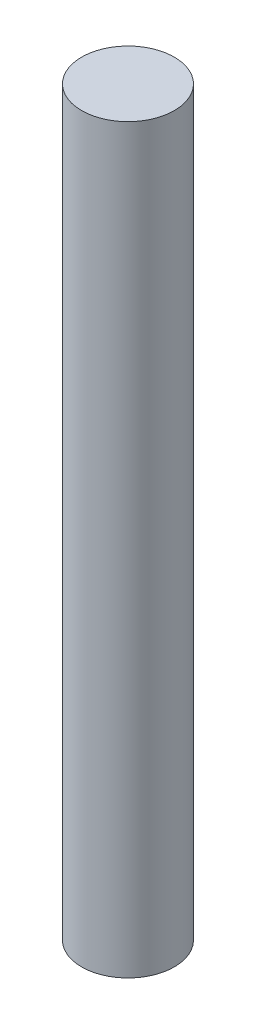
ISO-10303-21;
HEADER;
FILE_DESCRIPTION(('STEP AP214'),'2;1');
FILE_NAME('part.step','',(''),(''),'','','');
FILE_SCHEMA(('AUTOMOTIVE_DESIGN { 1 0 10303 214 1 1 1 1 }'));
ENDSEC;
DATA;
#1=APPLICATION_CONTEXT('core data for automotive mechanical design processes');
#2=APPLICATION_PROTOCOL_DEFINITION('international standard','automotive_design',2000,#1);
#3=PRODUCT_CONTEXT('',#1,'mechanical');
#4=PRODUCT('Part','Part','',(#3));
#5=PRODUCT_RELATED_PRODUCT_CATEGORY('part','',(#4));
#6=PRODUCT_DEFINITION_FORMATION('','',#4);
#7=PRODUCT_DEFINITION_CONTEXT('part definition',#1,'design');
#8=PRODUCT_DEFINITION('design','',#6,#7);
#9=PRODUCT_DEFINITION_SHAPE('','',#8);
#10=(LENGTH_UNIT() NAMED_UNIT(*) SI_UNIT(.MILLI.,.METRE.));
#11=(NAMED_UNIT(*) PLANE_ANGLE_UNIT() SI_UNIT($,.RADIAN.));
#12=(NAMED_UNIT(*) SI_UNIT($,.STERADIAN.) SOLID_ANGLE_UNIT());
#13=UNCERTAINTY_MEASURE_WITH_UNIT(LENGTH_MEASURE(1.E-05),#10,'distance_accuracy_value','');
#14=(GEOMETRIC_REPRESENTATION_CONTEXT(3) GLOBAL_UNCERTAINTY_ASSIGNED_CONTEXT((#13)) GLOBAL_UNIT_ASSIGNED_CONTEXT((#10,
#11,#12)) REPRESENTATION_CONTEXT('',''));
#15=CARTESIAN_POINT('',(0.,0.,0.));
#16=DIRECTION('',(0.,0.,1.));
#17=DIRECTION('',(1.,0.,0.));
#18=AXIS2_PLACEMENT_3D('',#15,#16,#17);
#19=CARTESIAN_POINT('',(0.,32.,0.));
#20=DIRECTION('',(0.,-1.,0.));
#21=DIRECTION('',(0.,0.,-1.));
#22=AXIS2_PLACEMENT_3D('',#19,#20,#21);
#23=CYLINDRICAL_SURFACE('',#22,2.);
#24=CARTESIAN_POINT('',(0.,32.,0.));
#25=DIRECTION('',(0.,1.,0.));
#26=DIRECTION('',(0.,0.,1.));
#27=AXIS2_PLACEMENT_3D('',#24,#25,#26);
#28=CIRCLE('',#27,2.);
#29=CARTESIAN_POINT('',(0.,32.,2.));
#30=VERTEX_POINT('',#29);
#31=EDGE_CURVE('E10',#30,#30,#28,.T.);
#32=ORIENTED_EDGE('',*,*,#31,.F.);
#33=EDGE_LOOP('',(#32));
#34=FACE_BOUND('',#33,.T.);
#35=CARTESIAN_POINT('',(0.,0.,0.));
#36=DIRECTION('',(0.,1.,0.));
#37=DIRECTION('',(0.,0.,1.));
#38=AXIS2_PLACEMENT_3D('',#35,#36,#37);
#39=CIRCLE('',#38,2.);
#40=CARTESIAN_POINT('',(0.,0.,2.));
#41=VERTEX_POINT('',#40);
#42=EDGE_CURVE('E33',#41,#41,#39,.T.);
#43=ORIENTED_EDGE('',*,*,#42,.T.);
#44=EDGE_LOOP('',(#43));
#45=FACE_BOUND('',#44,.T.);
#46=ADVANCED_FACE('F30',(#34,#45),#23,.T.);
#47=CARTESIAN_POINT('',(0.,32.,0.));
#48=DIRECTION('',(0.,1.,0.));
#49=DIRECTION('',(0.,0.,1.));
#50=AXIS2_PLACEMENT_3D('',#47,#48,#49);
#51=PLANE('',#50);
#52=ORIENTED_EDGE('',*,*,#31,.T.);
#53=EDGE_LOOP('',(#52));
#54=FACE_BOUND('',#53,.T.);
#55=ADVANCED_FACE('F45',(#54),#51,.T.);
#56=CARTESIAN_POINT('',(0.,0.,0.));
#57=DIRECTION('',(0.,1.,0.));
#58=DIRECTION('',(0.,0.,1.));
#59=AXIS2_PLACEMENT_3D('',#56,#57,#58);
#60=PLANE('',#59);
#61=ORIENTED_EDGE('',*,*,#42,.F.);
#62=EDGE_LOOP('',(#61));
#63=FACE_BOUND('',#62,.T.);
#64=ADVANCED_FACE('F43',(#63),#60,.F.);
#65=CLOSED_SHELL('',(#46,#55,#64));
#66=MANIFOLD_SOLID_BREP('B2',#65);
#67=ADVANCED_BREP_SHAPE_REPRESENTATION('',(#18,#66),#14);
#68=SHAPE_DEFINITION_REPRESENTATION(#9,#67);
ENDSEC;
END-ISO-10303-21;
